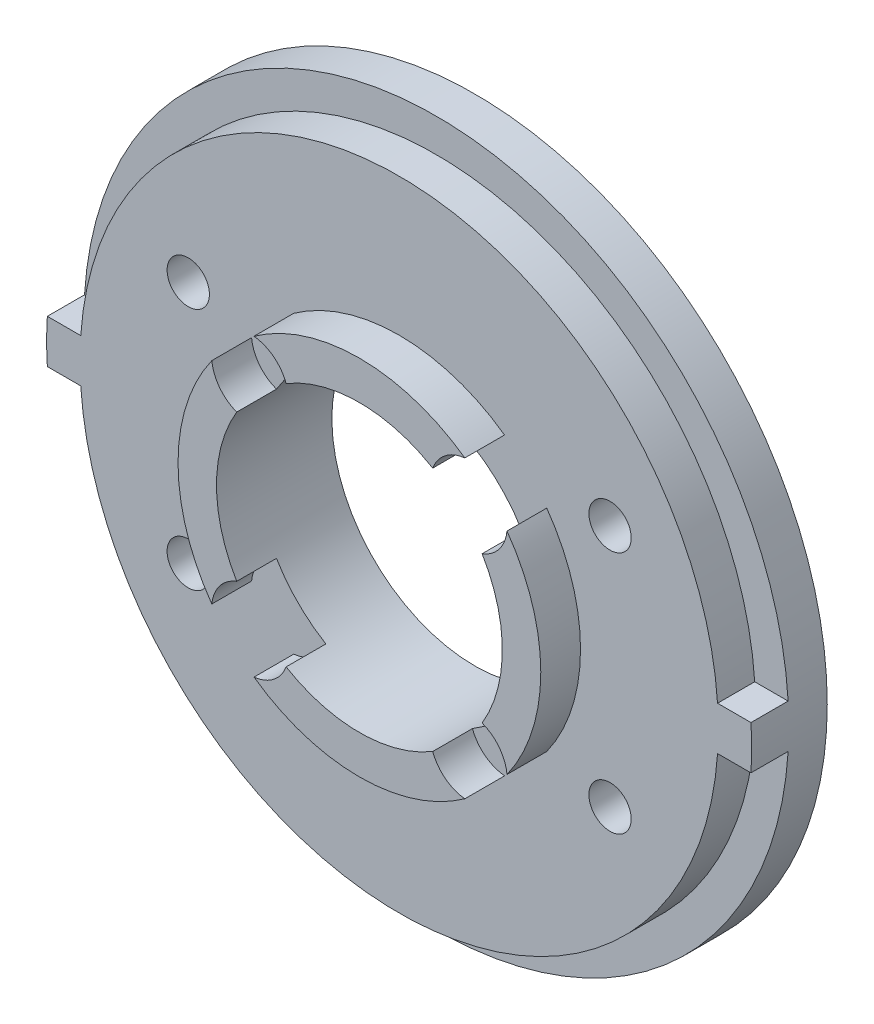
ISO-10303-21;
HEADER;
FILE_DESCRIPTION(('STEP AP214'),'2;1');
FILE_NAME('part.step','',(''),(''),'','','');
FILE_SCHEMA(('AUTOMOTIVE_DESIGN { 1 0 10303 214 1 1 1 1 }'));
ENDSEC;
DATA;
#1=APPLICATION_CONTEXT('core data for automotive mechanical design processes');
#2=APPLICATION_PROTOCOL_DEFINITION('international standard','automotive_design',2000,#1);
#3=PRODUCT_CONTEXT('',#1,'mechanical');
#4=PRODUCT('Part','Part','',(#3));
#5=PRODUCT_RELATED_PRODUCT_CATEGORY('part','',(#4));
#6=PRODUCT_DEFINITION_FORMATION('','',#4);
#7=PRODUCT_DEFINITION_CONTEXT('part definition',#1,'design');
#8=PRODUCT_DEFINITION('design','',#6,#7);
#9=PRODUCT_DEFINITION_SHAPE('','',#8);
#10=(LENGTH_UNIT() NAMED_UNIT(*) SI_UNIT(.MILLI.,.METRE.));
#11=(NAMED_UNIT(*) PLANE_ANGLE_UNIT() SI_UNIT($,.RADIAN.));
#12=(NAMED_UNIT(*) SI_UNIT($,.STERADIAN.) SOLID_ANGLE_UNIT());
#13=UNCERTAINTY_MEASURE_WITH_UNIT(LENGTH_MEASURE(1.E-05),#10,'distance_accuracy_value','');
#14=(GEOMETRIC_REPRESENTATION_CONTEXT(3) GLOBAL_UNCERTAINTY_ASSIGNED_CONTEXT((#13)) GLOBAL_UNIT_ASSIGNED_CONTEXT((#10,
#11,#12)) REPRESENTATION_CONTEXT('',''));
#15=CARTESIAN_POINT('',(0.,0.,0.));
#16=DIRECTION('',(0.,0.,1.));
#17=DIRECTION('',(1.,0.,0.));
#18=AXIS2_PLACEMENT_3D('',#15,#16,#17);
#19=CARTESIAN_POINT('',(0.,0.,9.));
#20=DIRECTION('',(0.,0.,1.));
#21=DIRECTION('',(1.,0.,0.));
#22=AXIS2_PLACEMENT_3D('',#19,#20,#21);
#23=PLANE('',#22);
#24=CARTESIAN_POINT('',(-8.53098997819986,-8.53098997819959,9.));
#25=DIRECTION('',(0.,0.,1.));
#26=DIRECTION('',(1.,0.,0.));
#27=AXIS2_PLACEMENT_3D('',#24,#25,#26);
#28=CIRCLE('',#27,3.);
#29=CARTESIAN_POINT('',(-9.57245655865993,-5.71756726524214,9.));
#30=VERTEX_POINT('',#29);
#31=CARTESIAN_POINT('',(-11.5151733018855,-8.2233377546799,9.));
#32=VERTEX_POINT('',#31);
#33=EDGE_CURVE('E451',#30,#32,#28,.T.);
#34=ORIENTED_EDGE('',*,*,#33,.F.);
#35=CARTESIAN_POINT('',(0.,0.,9.));
#36=DIRECTION('',(0.,0.,1.));
#37=DIRECTION('',(1.,0.,0.));
#38=AXIS2_PLACEMENT_3D('',#35,#36,#37);
#39=CIRCLE('',#38,11.15);
#40=CARTESIAN_POINT('',(-9.57245655865981,5.71756726524235,9.));
#41=VERTEX_POINT('',#40);
#42=EDGE_CURVE('E527',#41,#30,#39,.T.);
#43=ORIENTED_EDGE('',*,*,#42,.F.);
#44=CARTESIAN_POINT('',(-8.53098997819968,8.53098997819977,9.));
#45=DIRECTION('',(0.,0.,1.));
#46=DIRECTION('',(1.,0.,0.));
#47=AXIS2_PLACEMENT_3D('',#44,#45,#46);
#48=CIRCLE('',#47,3.);
#49=CARTESIAN_POINT('',(-11.5151733018853,8.22333775468014,9.));
#50=VERTEX_POINT('',#49);
#51=EDGE_CURVE('E214',#50,#41,#48,.T.);
#52=ORIENTED_EDGE('',*,*,#51,.F.);
#53=CARTESIAN_POINT('',(0.,0.,9.));
#54=DIRECTION('',(0.,0.,1.));
#55=DIRECTION('',(1.,0.,0.));
#56=AXIS2_PLACEMENT_3D('',#53,#54,#55);
#57=CIRCLE('',#56,14.15);
#58=EDGE_CURVE('E533',#50,#32,#57,.T.);
#59=ORIENTED_EDGE('',*,*,#58,.T.);
#60=EDGE_LOOP('',(#34,#43,#52,#59));
#61=FACE_BOUND('',#60,.T.);
#62=ADVANCED_FACE('F45',(#61),#23,.T.);
#63=CARTESIAN_POINT('',(8.53098997820016,-8.53098997819929,9.));
#64=DIRECTION('',(0.,0.,1.));
#65=DIRECTION('',(1.,0.,0.));
#66=AXIS2_PLACEMENT_3D('',#63,#64,#65);
#67=CIRCLE('',#66,3.00000000000068);
#68=CARTESIAN_POINT('',(11.5151733018864,-8.22333775467866,9.));
#69=VERTEX_POINT('',#68);
#70=CARTESIAN_POINT('',(9.57245655866048,-5.71756726524122,9.));
#71=VERTEX_POINT('',#70);
#72=EDGE_CURVE('E449',#69,#71,#67,.T.);
#73=ORIENTED_EDGE('',*,*,#72,.F.);
#74=CARTESIAN_POINT('',(11.5151733018854,8.22333775467998,9.));
#75=VERTEX_POINT('',#74);
#76=EDGE_CURVE('E288',#69,#75,#57,.T.);
#77=ORIENTED_EDGE('',*,*,#76,.T.);
#78=CARTESIAN_POINT('',(8.5309899781998,8.53098997819965,9.));
#79=DIRECTION('',(0.,0.,1.));
#80=DIRECTION('',(1.,0.,0.));
#81=AXIS2_PLACEMENT_3D('',#78,#79,#80);
#82=CIRCLE('',#81,3.);
#83=CARTESIAN_POINT('',(9.57245655865989,5.71756726524221,9.));
#84=VERTEX_POINT('',#83);
#85=EDGE_CURVE('E463',#84,#75,#82,.T.);
#86=ORIENTED_EDGE('',*,*,#85,.F.);
#87=EDGE_CURVE('E385',#71,#84,#39,.T.);
#88=ORIENTED_EDGE('',*,*,#87,.F.);
#89=EDGE_LOOP('',(#73,#77,#86,#88));
#90=FACE_BOUND('',#89,.T.);
#91=ADVANCED_FACE('F498',(#90),#23,.T.);
#92=CARTESIAN_POINT('',(8.22333775468018,11.5151733018853,9.));
#93=VERTEX_POINT('',#92);
#94=CARTESIAN_POINT('',(5.71756726524238,9.57245655865979,9.));
#95=VERTEX_POINT('',#94);
#96=EDGE_CURVE('E461',#93,#95,#82,.T.);
#97=ORIENTED_EDGE('',*,*,#96,.F.);
#98=CARTESIAN_POINT('',(-8.22333775468002,11.5151733018854,9.));
#99=VERTEX_POINT('',#98);
#100=EDGE_CURVE('E294',#93,#99,#57,.T.);
#101=ORIENTED_EDGE('',*,*,#100,.T.);
#102=CARTESIAN_POINT('',(-5.71756726524225,9.57245655865987,9.));
#103=VERTEX_POINT('',#102);
#104=EDGE_CURVE('E454',#103,#99,#48,.T.);
#105=ORIENTED_EDGE('',*,*,#104,.F.);
#106=EDGE_CURVE('E390',#95,#103,#39,.T.);
#107=ORIENTED_EDGE('',*,*,#106,.F.);
#108=EDGE_LOOP('',(#97,#101,#105,#107));
#109=FACE_BOUND('',#108,.T.);
#110=ADVANCED_FACE('F560',(#109),#23,.T.);
#111=CARTESIAN_POINT('',(0.,0.,5.9));
#112=DIRECTION('',(0.,0.,1.));
#113=DIRECTION('',(1.,0.,0.));
#114=AXIS2_PLACEMENT_3D('',#111,#112,#113);
#115=CYLINDRICAL_SURFACE('',#114,14.15);
#116=DIRECTION('',(0.,0.,1.));
#117=VECTOR('',#116,1.);
#118=CARTESIAN_POINT('',(-8.22333775468027,-11.5151733018852,7.45));
#119=LINE('',#118,#117);
#120=CARTESIAN_POINT('',(-8.22333775468027,-11.5151733018852,5.9));
#121=VERTEX_POINT('',#120);
#122=CARTESIAN_POINT('',(-8.22333775468027,-11.5151733018852,9.));
#123=VERTEX_POINT('',#122);
#124=EDGE_CURVE('E11',#121,#123,#119,.T.);
#125=ORIENTED_EDGE('',*,*,#124,.F.);
#126=CARTESIAN_POINT('',(0.,0.,5.9));
#127=DIRECTION('',(0.,0.,1.));
#128=DIRECTION('',(1.,0.,0.));
#129=AXIS2_PLACEMENT_3D('',#126,#127,#128);
#130=CIRCLE('',#129,14.15);
#131=CARTESIAN_POINT('',(8.22333775467983,-11.5151733018855,5.9));
#132=VERTEX_POINT('',#131);
#133=EDGE_CURVE('E293',#121,#132,#130,.T.);
#134=ORIENTED_EDGE('',*,*,#133,.T.);
#135=DIRECTION('',(0.,0.,1.));
#136=VECTOR('',#135,1.);
#137=CARTESIAN_POINT('',(8.22333775467983,-11.5151733018855,7.45));
#138=LINE('',#137,#136);
#139=CARTESIAN_POINT('',(8.22333775467983,-11.5151733018855,9.));
#140=VERTEX_POINT('',#139);
#141=EDGE_CURVE('E416',#140,#132,#138,.F.);
#142=ORIENTED_EDGE('',*,*,#141,.F.);
#143=EDGE_CURVE('E299',#123,#140,#57,.T.);
#144=ORIENTED_EDGE('',*,*,#143,.F.);
#145=EDGE_LOOP('',(#125,#134,#142,#144));
#146=FACE_BOUND('',#145,.T.);
#147=ADVANCED_FACE('F519',(#146),#115,.T.);
#148=DIRECTION('',(0.,0.,1.));
#149=VECTOR('',#148,1.);
#150=CARTESIAN_POINT('',(11.5151733018864,-8.22333775467865,7.45));
#151=LINE('',#150,#149);
#152=CARTESIAN_POINT('',(11.5151733018864,-8.22333775467866,5.9));
#153=VERTEX_POINT('',#152);
#154=EDGE_CURVE('E419',#153,#69,#151,.T.);
#155=ORIENTED_EDGE('',*,*,#154,.F.);
#156=CARTESIAN_POINT('',(11.5151733018854,8.22333775467998,5.9));
#157=VERTEX_POINT('',#156);
#158=EDGE_CURVE('E289',#153,#157,#130,.T.);
#159=ORIENTED_EDGE('',*,*,#158,.T.);
#160=DIRECTION('',(0.,0.,1.));
#161=VECTOR('',#160,1.);
#162=CARTESIAN_POINT('',(11.5151733018854,8.22333775467997,7.45));
#163=LINE('',#162,#161);
#164=EDGE_CURVE('E409',#75,#157,#163,.F.);
#165=ORIENTED_EDGE('',*,*,#164,.F.);
#166=ORIENTED_EDGE('',*,*,#76,.F.);
#167=EDGE_LOOP('',(#155,#159,#165,#166));
#168=FACE_BOUND('',#167,.T.);
#169=ADVANCED_FACE('F487',(#168),#115,.T.);
#170=DIRECTION('',(0.,0.,1.));
#171=VECTOR('',#170,1.);
#172=CARTESIAN_POINT('',(8.22333775468018,11.5151733018853,7.45));
#173=LINE('',#172,#171);
#174=CARTESIAN_POINT('',(8.22333775468018,11.5151733018853,5.9));
#175=VERTEX_POINT('',#174);
#176=EDGE_CURVE('E413',#175,#93,#173,.T.);
#177=ORIENTED_EDGE('',*,*,#176,.F.);
#178=CARTESIAN_POINT('',(-8.22333775468002,11.5151733018854,5.9));
#179=VERTEX_POINT('',#178);
#180=EDGE_CURVE('E295',#175,#179,#130,.T.);
#181=ORIENTED_EDGE('',*,*,#180,.T.);
#182=DIRECTION('',(0.,0.,1.));
#183=VECTOR('',#182,1.);
#184=CARTESIAN_POINT('',(-8.22333775468001,11.5151733018854,7.45));
#185=LINE('',#184,#183);
#186=EDGE_CURVE('E402',#99,#179,#185,.F.);
#187=ORIENTED_EDGE('',*,*,#186,.F.);
#188=ORIENTED_EDGE('',*,*,#100,.F.);
#189=EDGE_LOOP('',(#177,#181,#187,#188));
#190=FACE_BOUND('',#189,.T.);
#191=ADVANCED_FACE('F508',(#190),#115,.T.);
#192=CARTESIAN_POINT('',(-5.71756726524245,-9.57245655865974,9.));
#193=VERTEX_POINT('',#192);
#194=EDGE_CURVE('E446',#123,#193,#28,.T.);
#195=ORIENTED_EDGE('',*,*,#194,.F.);
#196=ORIENTED_EDGE('',*,*,#143,.T.);
#197=CARTESIAN_POINT('',(5.7175672652422,-9.5724565586599,9.));
#198=VERTEX_POINT('',#197);
#199=EDGE_CURVE('E473',#198,#140,#67,.T.);
#200=ORIENTED_EDGE('',*,*,#199,.F.);
#201=EDGE_CURVE('E389',#193,#198,#39,.T.);
#202=ORIENTED_EDGE('',*,*,#201,.F.);
#203=EDGE_LOOP('',(#195,#196,#200,#202));
#204=FACE_BOUND('',#203,.T.);
#205=ADVANCED_FACE('F540',(#204),#23,.T.);
#206=CARTESIAN_POINT('',(0.,0.,9.));
#207=DIRECTION('',(0.,0.,-1.));
#208=DIRECTION('',(-1.,0.,0.));
#209=AXIS2_PLACEMENT_3D('',#206,#207,#208);
#210=CYLINDRICAL_SURFACE('',#209,27.5);
#211=CARTESIAN_POINT('',(0.,0.,0.));
#212=DIRECTION('',(0.,0.,1.));
#213=DIRECTION('',(1.,0.,0.));
#214=AXIS2_PLACEMENT_3D('',#211,#212,#213);
#215=CIRCLE('',#214,27.5);
#216=CARTESIAN_POINT('',(27.5,0.,0.));
#217=VERTEX_POINT('',#216);
#218=EDGE_CURVE('E394',#217,#217,#215,.T.);
#219=ORIENTED_EDGE('',*,*,#218,.T.);
#220=EDGE_LOOP('',(#219));
#221=FACE_BOUND('',#220,.T.);
#222=CARTESIAN_POINT('',(0.,0.,5.9));
#223=DIRECTION('',(0.,0.,1.));
#224=DIRECTION('',(1.,0.,0.));
#225=AXIS2_PLACEMENT_3D('',#222,#223,#224);
#226=CIRCLE('',#225,27.5);
#227=CARTESIAN_POINT('',(-27.4474042488538,1.69999999999999,5.9));
#228=VERTEX_POINT('',#227);
#229=CARTESIAN_POINT('',(-27.4474042488538,-1.7,5.9));
#230=VERTEX_POINT('',#229);
#231=EDGE_CURVE('E311',#228,#230,#226,.T.);
#232=ORIENTED_EDGE('',*,*,#231,.F.);
#233=DIRECTION('',(0.,0.,1.));
#234=VECTOR('',#233,1.);
#235=CARTESIAN_POINT('',(-27.4474042488538,1.69999999999999,3.));
#236=LINE('',#235,#234);
#237=CARTESIAN_POINT('',(-27.4474042488538,1.69999999999999,3.));
#238=VERTEX_POINT('',#237);
#239=EDGE_CURVE('E364',#238,#228,#236,.T.);
#240=ORIENTED_EDGE('',*,*,#239,.F.);
#241=CARTESIAN_POINT('',(0.,0.,3.));
#242=DIRECTION('',(0.,0.,1.));
#243=DIRECTION('',(1.,0.,0.));
#244=AXIS2_PLACEMENT_3D('',#241,#242,#243);
#245=CIRCLE('',#244,27.5);
#246=CARTESIAN_POINT('',(27.4474042488538,1.7,3.));
#247=VERTEX_POINT('',#246);
#248=EDGE_CURVE('E372',#247,#238,#245,.T.);
#249=ORIENTED_EDGE('',*,*,#248,.F.);
#250=DIRECTION('',(0.,0.,1.));
#251=VECTOR('',#250,1.);
#252=CARTESIAN_POINT('',(27.4474042488538,1.7,3.));
#253=LINE('',#252,#251);
#254=CARTESIAN_POINT('',(27.4474042488539,1.7,5.9));
#255=VERTEX_POINT('',#254);
#256=EDGE_CURVE('E368',#247,#255,#253,.T.);
#257=ORIENTED_EDGE('',*,*,#256,.T.);
#258=CARTESIAN_POINT('',(27.4474042488538,-1.7,5.9));
#259=VERTEX_POINT('',#258);
#260=EDGE_CURVE('E308',#259,#255,#226,.T.);
#261=ORIENTED_EDGE('',*,*,#260,.F.);
#262=DIRECTION('',(0.,0.,1.));
#263=VECTOR('',#262,1.);
#264=CARTESIAN_POINT('',(27.4474042488538,-1.7,3.));
#265=LINE('',#264,#263);
#266=CARTESIAN_POINT('',(27.4474042488538,-1.7,3.));
#267=VERTEX_POINT('',#266);
#268=EDGE_CURVE('E344',#267,#259,#265,.T.);
#269=ORIENTED_EDGE('',*,*,#268,.F.);
#270=CARTESIAN_POINT('',(0.,0.,3.));
#271=DIRECTION('',(0.,0.,1.));
#272=DIRECTION('',(1.,0.,0.));
#273=AXIS2_PLACEMENT_3D('',#270,#271,#272);
#274=CIRCLE('',#273,27.5);
#275=CARTESIAN_POINT('',(-27.4474042488538,-1.7,3.));
#276=VERTEX_POINT('',#275);
#277=EDGE_CURVE('E336',#276,#267,#274,.T.);
#278=ORIENTED_EDGE('',*,*,#277,.F.);
#279=DIRECTION('',(0.,0.,1.));
#280=VECTOR('',#279,1.);
#281=CARTESIAN_POINT('',(-27.4474042488538,-1.69999999999999,3.));
#282=LINE('',#281,#280);
#283=EDGE_CURVE('E340',#276,#230,#282,.T.);
#284=ORIENTED_EDGE('',*,*,#283,.T.);
#285=EDGE_LOOP('',(#232,#240,#249,#257,#261,#269,#278,#284));
#286=FACE_BOUND('',#285,.T.);
#287=ADVANCED_FACE('F47',(#221,#286),#210,.T.);
#288=CARTESIAN_POINT('',(0.,1.7,3.));
#289=DIRECTION('',(0.,1.,0.));
#290=DIRECTION('',(-1.,0.,0.));
#291=AXIS2_PLACEMENT_3D('',#288,#289,#290);
#292=PLANE('',#291);
#293=DIRECTION('',(0.,0.,1.));
#294=VECTOR('',#293,1.);
#295=CARTESIAN_POINT('',(24.8401766298068,1.7,3.));
#296=LINE('',#295,#294);
#297=CARTESIAN_POINT('',(24.8401766298068,1.7,3.));
#298=VERTEX_POINT('',#297);
#299=CARTESIAN_POINT('',(24.8401766298068,1.7,5.9));
#300=VERTEX_POINT('',#299);
#301=EDGE_CURVE('E324',#298,#300,#296,.T.);
#302=ORIENTED_EDGE('',*,*,#301,.T.);
#303=DIRECTION('',(1.,0.,0.));
#304=VECTOR('',#303,1.);
#305=CARTESIAN_POINT('',(0.,1.7,5.9));
#306=LINE('',#305,#304);
#307=EDGE_CURVE('E320',#300,#255,#306,.T.);
#308=ORIENTED_EDGE('',*,*,#307,.T.);
#309=ORIENTED_EDGE('',*,*,#256,.F.);
#310=DIRECTION('',(-1.,0.,0.));
#311=VECTOR('',#310,1.);
#312=CARTESIAN_POINT('',(0.,1.7,3.));
#313=LINE('',#312,#311);
#314=EDGE_CURVE('E330',#247,#298,#313,.T.);
#315=ORIENTED_EDGE('',*,*,#314,.T.);
#316=EDGE_LOOP('',(#302,#308,#309,#315));
#317=FACE_BOUND('',#316,.T.);
#318=ADVANCED_FACE('F567',(#317),#292,.T.);
#319=CARTESIAN_POINT('',(0.,0.,3.));
#320=DIRECTION('',(0.,0.,1.));
#321=DIRECTION('',(1.,0.,0.));
#322=AXIS2_PLACEMENT_3D('',#319,#320,#321);
#323=CYLINDRICAL_SURFACE('',#322,24.8982805631232);
#324=DIRECTION('',(0.,0.,1.));
#325=VECTOR('',#324,1.);
#326=CARTESIAN_POINT('',(-24.8401766298068,1.7,3.));
#327=LINE('',#326,#325);
#328=CARTESIAN_POINT('',(-24.8401766298068,1.7,3.));
#329=VERTEX_POINT('',#328);
#330=CARTESIAN_POINT('',(-24.8401766298068,1.7,5.9));
#331=VERTEX_POINT('',#330);
#332=EDGE_CURVE('E360',#329,#331,#327,.T.);
#333=ORIENTED_EDGE('',*,*,#332,.T.);
#334=CARTESIAN_POINT('',(0.,0.,5.9));
#335=DIRECTION('',(0.,0.,1.));
#336=DIRECTION('',(1.,0.,0.));
#337=AXIS2_PLACEMENT_3D('',#334,#335,#336);
#338=CIRCLE('',#337,24.8982805631232);
#339=EDGE_CURVE('E316',#331,#300,#338,.F.);
#340=ORIENTED_EDGE('',*,*,#339,.T.);
#341=ORIENTED_EDGE('',*,*,#301,.F.);
#342=CARTESIAN_POINT('',(0.,0.,3.));
#343=DIRECTION('',(0.,0.,1.));
#344=DIRECTION('',(1.,0.,0.));
#345=AXIS2_PLACEMENT_3D('',#342,#343,#344);
#346=CIRCLE('',#345,24.8982805631232);
#347=EDGE_CURVE('E379',#298,#329,#346,.T.);
#348=ORIENTED_EDGE('',*,*,#347,.T.);
#349=EDGE_LOOP('',(#333,#340,#341,#348));
#350=FACE_BOUND('',#349,.T.);
#351=ADVANCED_FACE('F676',(#350),#323,.T.);
#352=CARTESIAN_POINT('',(0.,1.7,3.));
#353=DIRECTION('',(0.,1.,0.));
#354=DIRECTION('',(-1.,0.,0.));
#355=AXIS2_PLACEMENT_3D('',#352,#353,#354);
#356=PLANE('',#355);
#357=ORIENTED_EDGE('',*,*,#239,.T.);
#358=DIRECTION('',(1.,0.,0.));
#359=VECTOR('',#358,1.);
#360=CARTESIAN_POINT('',(0.,1.7,5.9));
#361=LINE('',#360,#359);
#362=EDGE_CURVE('E312',#228,#331,#361,.T.);
#363=ORIENTED_EDGE('',*,*,#362,.T.);
#364=ORIENTED_EDGE('',*,*,#332,.F.);
#365=DIRECTION('',(-1.,0.,0.));
#366=VECTOR('',#365,1.);
#367=CARTESIAN_POINT('',(0.,1.7,3.));
#368=LINE('',#367,#366);
#369=EDGE_CURVE('E376',#329,#238,#368,.T.);
#370=ORIENTED_EDGE('',*,*,#369,.T.);
#371=EDGE_LOOP('',(#357,#363,#364,#370));
#372=FACE_BOUND('',#371,.T.);
#373=ADVANCED_FACE('F672',(#372),#356,.T.);
#374=CARTESIAN_POINT('',(0.,-1.7,3.));
#375=DIRECTION('',(0.,-1.,0.));
#376=DIRECTION('',(0.,0.,-1.));
#377=AXIS2_PLACEMENT_3D('',#374,#375,#376);
#378=PLANE('',#377);
#379=DIRECTION('',(0.,0.,1.));
#380=VECTOR('',#379,1.);
#381=CARTESIAN_POINT('',(-24.8419000883588,-1.7,3.));
#382=LINE('',#381,#380);
#383=CARTESIAN_POINT('',(-24.8419000883588,-1.7,3.));
#384=VERTEX_POINT('',#383);
#385=CARTESIAN_POINT('',(-24.8419000883588,-1.7,5.9));
#386=VERTEX_POINT('',#385);
#387=EDGE_CURVE('E352',#384,#386,#382,.T.);
#388=ORIENTED_EDGE('',*,*,#387,.T.);
#389=DIRECTION('',(-1.,0.,0.));
#390=VECTOR('',#389,1.);
#391=CARTESIAN_POINT('',(0.,-1.7,5.9));
#392=LINE('',#391,#390);
#393=EDGE_CURVE('E304',#386,#230,#392,.T.);
#394=ORIENTED_EDGE('',*,*,#393,.T.);
#395=ORIENTED_EDGE('',*,*,#283,.F.);
#396=DIRECTION('',(1.,0.,0.));
#397=VECTOR('',#396,1.);
#398=CARTESIAN_POINT('',(0.,-1.7,3.));
#399=LINE('',#398,#397);
#400=EDGE_CURVE('E325',#276,#384,#399,.T.);
#401=ORIENTED_EDGE('',*,*,#400,.T.);
#402=EDGE_LOOP('',(#388,#394,#395,#401));
#403=FACE_BOUND('',#402,.T.);
#404=ADVANCED_FACE('F675',(#403),#378,.T.);
#405=CARTESIAN_POINT('',(0.,0.,3.));
#406=DIRECTION('',(0.,0.,1.));
#407=DIRECTION('',(1.,0.,0.));
#408=AXIS2_PLACEMENT_3D('',#405,#406,#407);
#409=CYLINDRICAL_SURFACE('',#408,24.9);
#410=DIRECTION('',(0.,0.,1.));
#411=VECTOR('',#410,1.);
#412=CARTESIAN_POINT('',(24.8419000883588,-1.7,3.));
#413=LINE('',#412,#411);
#414=CARTESIAN_POINT('',(24.8419000883588,-1.7,3.));
#415=VERTEX_POINT('',#414);
#416=CARTESIAN_POINT('',(24.8419000883588,-1.7,5.9));
#417=VERTEX_POINT('',#416);
#418=EDGE_CURVE('E348',#415,#417,#413,.T.);
#419=ORIENTED_EDGE('',*,*,#418,.T.);
#420=CARTESIAN_POINT('',(0.,0.,5.9));
#421=DIRECTION('',(0.,0.,1.));
#422=DIRECTION('',(1.,0.,0.));
#423=AXIS2_PLACEMENT_3D('',#420,#421,#422);
#424=CIRCLE('',#423,24.9);
#425=EDGE_CURVE('E300',#417,#386,#424,.F.);
#426=ORIENTED_EDGE('',*,*,#425,.T.);
#427=ORIENTED_EDGE('',*,*,#387,.F.);
#428=CARTESIAN_POINT('',(0.,0.,3.));
#429=DIRECTION('',(0.,0.,1.));
#430=DIRECTION('',(1.,0.,0.));
#431=AXIS2_PLACEMENT_3D('',#428,#429,#430);
#432=CIRCLE('',#431,24.9);
#433=EDGE_CURVE('E329',#384,#415,#432,.T.);
#434=ORIENTED_EDGE('',*,*,#433,.T.);
#435=EDGE_LOOP('',(#419,#426,#427,#434));
#436=FACE_BOUND('',#435,.T.);
#437=ADVANCED_FACE('F686',(#436),#409,.T.);
#438=CARTESIAN_POINT('',(0.,-1.7,3.));
#439=DIRECTION('',(0.,-1.,0.));
#440=DIRECTION('',(0.,0.,-1.));
#441=AXIS2_PLACEMENT_3D('',#438,#439,#440);
#442=PLANE('',#441);
#443=ORIENTED_EDGE('',*,*,#268,.T.);
#444=DIRECTION('',(-1.,0.,0.));
#445=VECTOR('',#444,1.);
#446=CARTESIAN_POINT('',(0.,-1.7,5.9));
#447=LINE('',#446,#445);
#448=EDGE_CURVE('E398',#259,#417,#447,.T.);
#449=ORIENTED_EDGE('',*,*,#448,.T.);
#450=ORIENTED_EDGE('',*,*,#418,.F.);
#451=DIRECTION('',(1.,0.,0.));
#452=VECTOR('',#451,1.);
#453=CARTESIAN_POINT('',(0.,-1.7,3.));
#454=LINE('',#453,#452);
#455=EDGE_CURVE('E333',#415,#267,#454,.T.);
#456=ORIENTED_EDGE('',*,*,#455,.T.);
#457=EDGE_LOOP('',(#443,#449,#450,#456));
#458=FACE_BOUND('',#457,.T.);
#459=ADVANCED_FACE('F658',(#458),#442,.T.);
#460=CARTESIAN_POINT('',(0.,0.,0.));
#461=DIRECTION('',(0.,0.,1.));
#462=DIRECTION('',(1.,0.,0.));
#463=AXIS2_PLACEMENT_3D('',#460,#461,#462);
#464=PLANE('',#463);
#465=CARTESIAN_POINT('',(16.4544826719043,9.50000000000008,0.));
#466=DIRECTION('',(0.,0.,1.));
#467=DIRECTION('',(1.,0.,0.));
#468=AXIS2_PLACEMENT_3D('',#465,#466,#467);
#469=CIRCLE('',#468,3.3);
#470=CARTESIAN_POINT('',(19.7544826719043,9.50000000000008,0.));
#471=VERTEX_POINT('',#470);
#472=EDGE_CURVE('E640',#471,#471,#469,.T.);
#473=ORIENTED_EDGE('',*,*,#472,.T.);
#474=EDGE_LOOP('',(#473));
#475=FACE_BOUND('',#474,.T.);
#476=CARTESIAN_POINT('',(16.4544826719043,-9.50000000000008,0.));
#477=DIRECTION('',(0.,0.,1.));
#478=DIRECTION('',(1.,0.,0.));
#479=AXIS2_PLACEMENT_3D('',#476,#477,#478);
#480=CIRCLE('',#479,3.3);
#481=CARTESIAN_POINT('',(19.7544826719043,-9.50000000000008,0.));
#482=VERTEX_POINT('',#481);
#483=EDGE_CURVE('E630',#482,#482,#480,.T.);
#484=ORIENTED_EDGE('',*,*,#483,.T.);
#485=EDGE_LOOP('',(#484));
#486=FACE_BOUND('',#485,.T.);
#487=CARTESIAN_POINT('',(-16.4544826719043,-9.50000000000007,0.));
#488=DIRECTION('',(0.,0.,1.));
#489=DIRECTION('',(1.,0.,0.));
#490=AXIS2_PLACEMENT_3D('',#487,#488,#489);
#491=CIRCLE('',#490,3.3);
#492=CARTESIAN_POINT('',(-13.1544826719043,-9.50000000000007,0.));
#493=VERTEX_POINT('',#492);
#494=EDGE_CURVE('E622',#493,#493,#491,.T.);
#495=ORIENTED_EDGE('',*,*,#494,.T.);
#496=EDGE_LOOP('',(#495));
#497=FACE_BOUND('',#496,.T.);
#498=CARTESIAN_POINT('',(-16.4544826719043,9.50000000000007,0.));
#499=DIRECTION('',(0.,0.,1.));
#500=DIRECTION('',(1.,0.,0.));
#501=AXIS2_PLACEMENT_3D('',#498,#499,#500);
#502=CIRCLE('',#501,3.3);
#503=CARTESIAN_POINT('',(-13.1544826719043,9.50000000000007,0.));
#504=VERTEX_POINT('',#503);
#505=EDGE_CURVE('E625',#504,#504,#502,.T.);
#506=ORIENTED_EDGE('',*,*,#505,.T.);
#507=EDGE_LOOP('',(#506));
#508=FACE_BOUND('',#507,.T.);
#509=ORIENTED_EDGE('',*,*,#218,.F.);
#510=EDGE_LOOP('',(#509));
#511=FACE_BOUND('',#510,.T.);
#512=CARTESIAN_POINT('',(0.,0.,0.));
#513=DIRECTION('',(0.,0.,1.));
#514=DIRECTION('',(1.,0.,0.));
#515=AXIS2_PLACEMENT_3D('',#512,#513,#514);
#516=CIRCLE('',#515,11.15);
#517=CARTESIAN_POINT('',(11.15,0.,0.));
#518=VERTEX_POINT('',#517);
#519=EDGE_CURVE('E356',#518,#518,#516,.T.);
#520=ORIENTED_EDGE('',*,*,#519,.T.);
#521=EDGE_LOOP('',(#520));
#522=FACE_BOUND('',#521,.T.);
#523=ADVANCED_FACE('F655',(#475,#486,#497,#508,#511,#522),#464,.F.);
#524=CARTESIAN_POINT('',(0.,0.,9.));
#525=DIRECTION('',(0.,0.,-1.));
#526=DIRECTION('',(-1.,0.,0.));
#527=AXIS2_PLACEMENT_3D('',#524,#525,#526);
#528=CYLINDRICAL_SURFACE('',#527,11.15);
#529=DIRECTION('',(0.,0.,1.));
#530=VECTOR('',#529,1.);
#531=CARTESIAN_POINT('',(-9.57245655865993,-5.71756726524214,7.45));
#532=LINE('',#531,#530);
#533=CARTESIAN_POINT('',(-9.57245655865993,-5.71756726524214,5.9));
#534=VERTEX_POINT('',#533);
#535=EDGE_CURVE('E269',#534,#30,#532,.T.);
#536=ORIENTED_EDGE('',*,*,#535,.F.);
#537=CARTESIAN_POINT('',(0.,0.,5.9));
#538=DIRECTION('',(0.,0.,1.));
#539=DIRECTION('',(1.,0.,0.));
#540=AXIS2_PLACEMENT_3D('',#537,#538,#539);
#541=CIRCLE('',#540,11.15);
#542=CARTESIAN_POINT('',(-5.71756726524245,-9.57245655865974,5.9));
#543=VERTEX_POINT('',#542);
#544=EDGE_CURVE('E262',#534,#543,#541,.T.);
#545=ORIENTED_EDGE('',*,*,#544,.T.);
#546=DIRECTION('',(0.,0.,1.));
#547=VECTOR('',#546,1.);
#548=CARTESIAN_POINT('',(-5.71756726524245,-9.57245655865975,7.45));
#549=LINE('',#548,#547);
#550=EDGE_CURVE('E266',#193,#543,#549,.F.);
#551=ORIENTED_EDGE('',*,*,#550,.F.);
#552=ORIENTED_EDGE('',*,*,#201,.T.);
#553=DIRECTION('',(0.,0.,1.));
#554=VECTOR('',#553,1.);
#555=CARTESIAN_POINT('',(5.7175672652422,-9.5724565586599,7.45));
#556=LINE('',#555,#554);
#557=CARTESIAN_POINT('',(5.7175672652422,-9.5724565586599,5.9));
#558=VERTEX_POINT('',#557);
#559=EDGE_CURVE('E259',#558,#198,#556,.T.);
#560=ORIENTED_EDGE('',*,*,#559,.F.);
#561=CARTESIAN_POINT('',(0.,0.,5.9));
#562=DIRECTION('',(0.,0.,1.));
#563=DIRECTION('',(1.,0.,0.));
#564=AXIS2_PLACEMENT_3D('',#561,#562,#563);
#565=CIRCLE('',#564,11.15);
#566=CARTESIAN_POINT('',(9.57245655866048,-5.71756726524122,5.9));
#567=VERTEX_POINT('',#566);
#568=EDGE_CURVE('E252',#558,#567,#565,.T.);
#569=ORIENTED_EDGE('',*,*,#568,.T.);
#570=DIRECTION('',(0.,0.,1.));
#571=VECTOR('',#570,1.);
#572=CARTESIAN_POINT('',(9.57245655866048,-5.71756726524122,7.45));
#573=LINE('',#572,#571);
#574=EDGE_CURVE('E256',#71,#567,#573,.F.);
#575=ORIENTED_EDGE('',*,*,#574,.F.);
#576=ORIENTED_EDGE('',*,*,#87,.T.);
#577=DIRECTION('',(0.,0.,1.));
#578=VECTOR('',#577,1.);
#579=CARTESIAN_POINT('',(9.57245655865989,5.71756726524221,7.45));
#580=LINE('',#579,#578);
#581=CARTESIAN_POINT('',(9.57245655865989,5.71756726524221,5.9));
#582=VERTEX_POINT('',#581);
#583=EDGE_CURVE('E249',#582,#84,#580,.T.);
#584=ORIENTED_EDGE('',*,*,#583,.F.);
#585=CARTESIAN_POINT('',(0.,0.,5.9));
#586=DIRECTION('',(0.,0.,1.));
#587=DIRECTION('',(1.,0.,0.));
#588=AXIS2_PLACEMENT_3D('',#585,#586,#587);
#589=CIRCLE('',#588,11.15);
#590=CARTESIAN_POINT('',(5.71756726524238,9.57245655865979,5.9));
#591=VERTEX_POINT('',#590);
#592=EDGE_CURVE('E242',#582,#591,#589,.T.);
#593=ORIENTED_EDGE('',*,*,#592,.T.);
#594=DIRECTION('',(0.,0.,1.));
#595=VECTOR('',#594,1.);
#596=CARTESIAN_POINT('',(5.71756726524238,9.57245655865979,7.45));
#597=LINE('',#596,#595);
#598=EDGE_CURVE('E246',#95,#591,#597,.F.);
#599=ORIENTED_EDGE('',*,*,#598,.F.);
#600=ORIENTED_EDGE('',*,*,#106,.T.);
#601=DIRECTION('',(0.,0.,1.));
#602=VECTOR('',#601,1.);
#603=CARTESIAN_POINT('',(-5.71756726524225,9.57245655865987,7.45));
#604=LINE('',#603,#602);
#605=CARTESIAN_POINT('',(-5.71756726524225,9.57245655865987,5.9));
#606=VERTEX_POINT('',#605);
#607=EDGE_CURVE('E220',#606,#103,#604,.T.);
#608=ORIENTED_EDGE('',*,*,#607,.F.);
#609=CARTESIAN_POINT('',(0.,0.,5.9));
#610=DIRECTION('',(0.,0.,1.));
#611=DIRECTION('',(1.,0.,0.));
#612=AXIS2_PLACEMENT_3D('',#609,#610,#611);
#613=CIRCLE('',#612,11.15);
#614=CARTESIAN_POINT('',(-9.57245655865981,5.71756726524235,5.9));
#615=VERTEX_POINT('',#614);
#616=EDGE_CURVE('E221',#606,#615,#613,.T.);
#617=ORIENTED_EDGE('',*,*,#616,.T.);
#618=DIRECTION('',(0.,0.,1.));
#619=VECTOR('',#618,1.);
#620=CARTESIAN_POINT('',(-9.57245655865981,5.71756726524235,7.45));
#621=LINE('',#620,#619);
#622=EDGE_CURVE('E208',#41,#615,#621,.F.);
#623=ORIENTED_EDGE('',*,*,#622,.F.);
#624=ORIENTED_EDGE('',*,*,#42,.T.);
#625=EDGE_LOOP('',(#536,#545,#551,#552,#560,#569,#575,#576,#584,#593,#599,#600,#608,#617,#623,#624));
#626=FACE_BOUND('',#625,.T.);
#627=ORIENTED_EDGE('',*,*,#519,.F.);
#628=EDGE_LOOP('',(#627));
#629=FACE_BOUND('',#628,.T.);
#630=ADVANCED_FACE('F233',(#626,#629),#528,.F.);
#631=CARTESIAN_POINT('',(0.,0.,3.));
#632=DIRECTION('',(0.,0.,1.));
#633=DIRECTION('',(1.,0.,0.));
#634=AXIS2_PLACEMENT_3D('',#631,#632,#633);
#635=PLANE('',#634);
#636=ORIENTED_EDGE('',*,*,#314,.F.);
#637=ORIENTED_EDGE('',*,*,#248,.T.);
#638=ORIENTED_EDGE('',*,*,#369,.F.);
#639=ORIENTED_EDGE('',*,*,#347,.F.);
#640=EDGE_LOOP('',(#636,#637,#638,#639));
#641=FACE_BOUND('',#640,.T.);
#642=ADVANCED_FACE('F664',(#641),#635,.T.);
#643=CARTESIAN_POINT('',(0.,0.,3.));
#644=DIRECTION('',(0.,0.,1.));
#645=DIRECTION('',(1.,0.,0.));
#646=AXIS2_PLACEMENT_3D('',#643,#644,#645);
#647=PLANE('',#646);
#648=ORIENTED_EDGE('',*,*,#400,.F.);
#649=ORIENTED_EDGE('',*,*,#277,.T.);
#650=ORIENTED_EDGE('',*,*,#455,.F.);
#651=ORIENTED_EDGE('',*,*,#433,.F.);
#652=EDGE_LOOP('',(#648,#649,#650,#651));
#653=FACE_BOUND('',#652,.T.);
#654=ADVANCED_FACE('F668',(#653),#647,.T.);
#655=CARTESIAN_POINT('',(0.,0.,5.9));
#656=DIRECTION('',(0.,0.,1.));
#657=DIRECTION('',(1.,0.,0.));
#658=AXIS2_PLACEMENT_3D('',#655,#656,#657);
#659=PLANE('',#658);
#660=ORIENTED_EDGE('',*,*,#133,.F.);
#661=CARTESIAN_POINT('',(-8.53098997819986,-8.53098997819959,5.9));
#662=DIRECTION('',(0.,0.,1.));
#663=DIRECTION('',(1.,0.,0.));
#664=AXIS2_PLACEMENT_3D('',#661,#662,#663);
#665=CIRCLE('',#664,3.);
#666=EDGE_CURVE('E442',#543,#121,#665,.F.);
#667=ORIENTED_EDGE('',*,*,#666,.F.);
#668=ORIENTED_EDGE('',*,*,#544,.F.);
#669=CARTESIAN_POINT('',(-11.5151733018855,-8.2233377546799,5.9));
#670=VERTEX_POINT('',#669);
#671=EDGE_CURVE('E70',#670,#534,#665,.F.);
#672=ORIENTED_EDGE('',*,*,#671,.F.);
#673=CARTESIAN_POINT('',(-11.5151733018853,8.22333775468014,5.9));
#674=VERTEX_POINT('',#673);
#675=EDGE_CURVE('E227',#674,#670,#130,.T.);
#676=ORIENTED_EDGE('',*,*,#675,.F.);
#677=CARTESIAN_POINT('',(-8.53098997819968,8.53098997819977,5.9));
#678=DIRECTION('',(0.,0.,1.));
#679=DIRECTION('',(1.,0.,0.));
#680=AXIS2_PLACEMENT_3D('',#677,#678,#679);
#681=CIRCLE('',#680,3.);
#682=EDGE_CURVE('E211',#615,#674,#681,.F.);
#683=ORIENTED_EDGE('',*,*,#682,.F.);
#684=ORIENTED_EDGE('',*,*,#616,.F.);
#685=EDGE_CURVE('E229',#179,#606,#681,.F.);
#686=ORIENTED_EDGE('',*,*,#685,.F.);
#687=ORIENTED_EDGE('',*,*,#180,.F.);
#688=CARTESIAN_POINT('',(8.5309899781998,8.53098997819965,5.9));
#689=DIRECTION('',(0.,0.,1.));
#690=DIRECTION('',(1.,0.,0.));
#691=AXIS2_PLACEMENT_3D('',#688,#689,#690);
#692=CIRCLE('',#691,3.);
#693=EDGE_CURVE('E494',#591,#175,#692,.F.);
#694=ORIENTED_EDGE('',*,*,#693,.F.);
#695=ORIENTED_EDGE('',*,*,#592,.F.);
#696=EDGE_CURVE('E469',#157,#582,#692,.F.);
#697=ORIENTED_EDGE('',*,*,#696,.F.);
#698=ORIENTED_EDGE('',*,*,#158,.F.);
#699=CARTESIAN_POINT('',(8.53098997820016,-8.53098997819929,5.9));
#700=DIRECTION('',(0.,0.,1.));
#701=DIRECTION('',(1.,0.,0.));
#702=AXIS2_PLACEMENT_3D('',#699,#700,#701);
#703=CIRCLE('',#702,3.00000000000068);
#704=EDGE_CURVE('E453',#567,#153,#703,.F.);
#705=ORIENTED_EDGE('',*,*,#704,.F.);
#706=ORIENTED_EDGE('',*,*,#568,.F.);
#707=EDGE_CURVE('E63',#132,#558,#703,.F.);
#708=ORIENTED_EDGE('',*,*,#707,.F.);
#709=EDGE_LOOP('',(#660,#667,#668,#672,#676,#683,#684,#686,#687,#694,#695,#697,#698,#705,#706,#708));
#710=FACE_BOUND('',#709,.T.);
#711=CARTESIAN_POINT('',(-16.4544826719043,-9.50000000000007,5.9));
#712=DIRECTION('',(0.,0.,1.));
#713=DIRECTION('',(1.,0.,0.));
#714=AXIS2_PLACEMENT_3D('',#711,#712,#713);
#715=CIRCLE('',#714,1.65);
#716=CARTESIAN_POINT('',(-14.8044826719043,-9.50000000000007,5.9));
#717=VERTEX_POINT('',#716);
#718=EDGE_CURVE('E272',#717,#717,#715,.T.);
#719=ORIENTED_EDGE('',*,*,#718,.F.);
#720=EDGE_LOOP('',(#719));
#721=FACE_BOUND('',#720,.T.);
#722=CARTESIAN_POINT('',(16.4544826719043,-9.50000000000008,5.9));
#723=DIRECTION('',(0.,0.,1.));
#724=DIRECTION('',(1.,0.,0.));
#725=AXIS2_PLACEMENT_3D('',#722,#723,#724);
#726=CIRCLE('',#725,1.65);
#727=CARTESIAN_POINT('',(18.1044826719043,-9.50000000000008,5.9));
#728=VERTEX_POINT('',#727);
#729=EDGE_CURVE('E278',#728,#728,#726,.T.);
#730=ORIENTED_EDGE('',*,*,#729,.F.);
#731=EDGE_LOOP('',(#730));
#732=FACE_BOUND('',#731,.T.);
#733=CARTESIAN_POINT('',(16.4544826719043,9.50000000000008,5.9));
#734=DIRECTION('',(0.,0.,1.));
#735=DIRECTION('',(1.,0.,0.));
#736=AXIS2_PLACEMENT_3D('',#733,#734,#735);
#737=CIRCLE('',#736,1.65);
#738=CARTESIAN_POINT('',(18.1044826719043,9.50000000000008,5.9));
#739=VERTEX_POINT('',#738);
#740=EDGE_CURVE('E273',#739,#739,#737,.T.);
#741=ORIENTED_EDGE('',*,*,#740,.F.);
#742=EDGE_LOOP('',(#741));
#743=FACE_BOUND('',#742,.T.);
#744=CARTESIAN_POINT('',(-16.4544826719043,9.50000000000007,5.9));
#745=DIRECTION('',(0.,0.,1.));
#746=DIRECTION('',(1.,0.,0.));
#747=AXIS2_PLACEMENT_3D('',#744,#745,#746);
#748=CIRCLE('',#747,1.65);
#749=CARTESIAN_POINT('',(-14.8044826719043,9.50000000000007,5.9));
#750=VERTEX_POINT('',#749);
#751=EDGE_CURVE('E277',#750,#750,#748,.T.);
#752=ORIENTED_EDGE('',*,*,#751,.F.);
#753=EDGE_LOOP('',(#752));
#754=FACE_BOUND('',#753,.T.);
#755=ORIENTED_EDGE('',*,*,#339,.F.);
#756=ORIENTED_EDGE('',*,*,#362,.F.);
#757=ORIENTED_EDGE('',*,*,#231,.T.);
#758=ORIENTED_EDGE('',*,*,#393,.F.);
#759=ORIENTED_EDGE('',*,*,#425,.F.);
#760=ORIENTED_EDGE('',*,*,#448,.F.);
#761=ORIENTED_EDGE('',*,*,#260,.T.);
#762=ORIENTED_EDGE('',*,*,#307,.F.);
#763=EDGE_LOOP('',(#755,#756,#757,#758,#759,#760,#761,#762));
#764=FACE_BOUND('',#763,.T.);
#765=ADVANCED_FACE('F223',(#710,#721,#732,#743,#754,#764),#659,.T.);
#766=DIRECTION('',(0.,0.,1.));
#767=VECTOR('',#766,1.);
#768=CARTESIAN_POINT('',(-11.5151733018855,-8.2233377546799,7.45));
#769=LINE('',#768,#767);
#770=EDGE_CURVE('E55',#32,#670,#769,.F.);
#771=ORIENTED_EDGE('',*,*,#770,.F.);
#772=ORIENTED_EDGE('',*,*,#58,.F.);
#773=DIRECTION('',(0.,0.,1.));
#774=VECTOR('',#773,1.);
#775=CARTESIAN_POINT('',(-11.5151733018853,8.22333775468013,7.45));
#776=LINE('',#775,#774);
#777=EDGE_CURVE('E406',#674,#50,#776,.T.);
#778=ORIENTED_EDGE('',*,*,#777,.F.);
#779=ORIENTED_EDGE('',*,*,#675,.T.);
#780=EDGE_LOOP('',(#771,#772,#778,#779));
#781=FACE_BOUND('',#780,.T.);
#782=ADVANCED_FACE('F570',(#781),#115,.T.);
#783=CARTESIAN_POINT('',(-16.4544826719043,9.50000000000007,0.));
#784=DIRECTION('',(0.,0.,1.));
#785=DIRECTION('',(1.,0.,0.));
#786=AXIS2_PLACEMENT_3D('',#783,#784,#785);
#787=CYLINDRICAL_SURFACE('',#786,1.65);
#788=CARTESIAN_POINT('',(-16.4544826719043,9.50000000000007,2.1));
#789=DIRECTION('',(0.,0.,1.));
#790=DIRECTION('',(1.,0.,0.));
#791=AXIS2_PLACEMENT_3D('',#788,#789,#790);
#792=CIRCLE('',#791,1.65);
#793=CARTESIAN_POINT('',(-14.8044826719043,9.50000000000007,2.1));
#794=VERTEX_POINT('',#793);
#795=EDGE_CURVE('E49',#794,#794,#792,.F.);
#796=ORIENTED_EDGE('',*,*,#795,.T.);
#797=EDGE_LOOP('',(#796));
#798=FACE_BOUND('',#797,.T.);
#799=ORIENTED_EDGE('',*,*,#751,.T.);
#800=EDGE_LOOP('',(#799));
#801=FACE_BOUND('',#800,.T.);
#802=ADVANCED_FACE('F700',(#798,#801),#787,.F.);
#803=CARTESIAN_POINT('',(16.4544826719043,9.50000000000008,0.));
#804=DIRECTION('',(0.,0.,1.));
#805=DIRECTION('',(1.,0.,0.));
#806=AXIS2_PLACEMENT_3D('',#803,#804,#805);
#807=CYLINDRICAL_SURFACE('',#806,1.65);
#808=CARTESIAN_POINT('',(16.4544826719043,9.50000000000008,2.1));
#809=DIRECTION('',(0.,0.,1.));
#810=DIRECTION('',(1.,0.,0.));
#811=AXIS2_PLACEMENT_3D('',#808,#809,#810);
#812=CIRCLE('',#811,1.65);
#813=CARTESIAN_POINT('',(18.1044826719043,9.50000000000008,2.1));
#814=VERTEX_POINT('',#813);
#815=EDGE_CURVE('E432',#814,#814,#812,.F.);
#816=ORIENTED_EDGE('',*,*,#815,.T.);
#817=EDGE_LOOP('',(#816));
#818=FACE_BOUND('',#817,.T.);
#819=ORIENTED_EDGE('',*,*,#740,.T.);
#820=EDGE_LOOP('',(#819));
#821=FACE_BOUND('',#820,.T.);
#822=ADVANCED_FACE('F703',(#818,#821),#807,.F.);
#823=CARTESIAN_POINT('',(16.4544826719043,-9.50000000000008,0.));
#824=DIRECTION('',(0.,0.,1.));
#825=DIRECTION('',(1.,0.,0.));
#826=AXIS2_PLACEMENT_3D('',#823,#824,#825);
#827=CYLINDRICAL_SURFACE('',#826,1.65);
#828=CARTESIAN_POINT('',(16.4544826719043,-9.50000000000008,2.1));
#829=DIRECTION('',(0.,0.,1.));
#830=DIRECTION('',(1.,0.,0.));
#831=AXIS2_PLACEMENT_3D('',#828,#829,#830);
#832=CIRCLE('',#831,1.65);
#833=CARTESIAN_POINT('',(18.1044826719043,-9.50000000000008,2.1));
#834=VERTEX_POINT('',#833);
#835=EDGE_CURVE('E428',#834,#834,#832,.F.);
#836=ORIENTED_EDGE('',*,*,#835,.T.);
#837=EDGE_LOOP('',(#836));
#838=FACE_BOUND('',#837,.T.);
#839=ORIENTED_EDGE('',*,*,#729,.T.);
#840=EDGE_LOOP('',(#839));
#841=FACE_BOUND('',#840,.T.);
#842=ADVANCED_FACE('F708',(#838,#841),#827,.F.);
#843=CARTESIAN_POINT('',(-16.4544826719043,-9.50000000000007,0.));
#844=DIRECTION('',(0.,0.,1.));
#845=DIRECTION('',(1.,0.,0.));
#846=AXIS2_PLACEMENT_3D('',#843,#844,#845);
#847=CYLINDRICAL_SURFACE('',#846,1.65);
#848=CARTESIAN_POINT('',(-16.4544826719043,-9.50000000000007,2.1));
#849=DIRECTION('',(0.,0.,1.));
#850=DIRECTION('',(1.,0.,0.));
#851=AXIS2_PLACEMENT_3D('',#848,#849,#850);
#852=CIRCLE('',#851,1.65);
#853=CARTESIAN_POINT('',(-14.8044826719043,-9.50000000000007,2.1));
#854=VERTEX_POINT('',#853);
#855=EDGE_CURVE('E424',#854,#854,#852,.F.);
#856=ORIENTED_EDGE('',*,*,#855,.T.);
#857=EDGE_LOOP('',(#856));
#858=FACE_BOUND('',#857,.T.);
#859=ORIENTED_EDGE('',*,*,#718,.T.);
#860=EDGE_LOOP('',(#859));
#861=FACE_BOUND('',#860,.T.);
#862=ADVANCED_FACE('F704',(#858,#861),#847,.F.);
#863=CARTESIAN_POINT('',(-8.53098997819968,8.53098997819977,-2.58528137424048));
#864=DIRECTION('',(0.,0.,1.));
#865=DIRECTION('',(1.,0.,0.));
#866=AXIS2_PLACEMENT_3D('',#863,#864,#865);
#867=CYLINDRICAL_SURFACE('',#866,3.);
#868=ORIENTED_EDGE('',*,*,#607,.T.);
#869=ORIENTED_EDGE('',*,*,#104,.T.);
#870=ORIENTED_EDGE('',*,*,#186,.T.);
#871=ORIENTED_EDGE('',*,*,#685,.T.);
#872=EDGE_LOOP('',(#868,#869,#870,#871));
#873=FACE_BOUND('',#872,.T.);
#874=ADVANCED_FACE('F707',(#873),#867,.F.);
#875=ORIENTED_EDGE('',*,*,#622,.T.);
#876=ORIENTED_EDGE('',*,*,#682,.T.);
#877=ORIENTED_EDGE('',*,*,#777,.T.);
#878=ORIENTED_EDGE('',*,*,#51,.T.);
#879=EDGE_LOOP('',(#875,#876,#877,#878));
#880=FACE_BOUND('',#879,.T.);
#881=ADVANCED_FACE('F210',(#880),#867,.F.);
#882=CARTESIAN_POINT('',(8.5309899781998,8.53098997819965,-2.58528137424048));
#883=DIRECTION('',(0.,0.,1.));
#884=DIRECTION('',(1.,0.,0.));
#885=AXIS2_PLACEMENT_3D('',#882,#883,#884);
#886=CYLINDRICAL_SURFACE('',#885,3.);
#887=ORIENTED_EDGE('',*,*,#583,.T.);
#888=ORIENTED_EDGE('',*,*,#85,.T.);
#889=ORIENTED_EDGE('',*,*,#164,.T.);
#890=ORIENTED_EDGE('',*,*,#696,.T.);
#891=EDGE_LOOP('',(#887,#888,#889,#890));
#892=FACE_BOUND('',#891,.T.);
#893=ADVANCED_FACE('F495',(#892),#886,.F.);
#894=ORIENTED_EDGE('',*,*,#598,.T.);
#895=ORIENTED_EDGE('',*,*,#693,.T.);
#896=ORIENTED_EDGE('',*,*,#176,.T.);
#897=ORIENTED_EDGE('',*,*,#96,.T.);
#898=EDGE_LOOP('',(#894,#895,#896,#897));
#899=FACE_BOUND('',#898,.T.);
#900=ADVANCED_FACE('F503',(#899),#886,.F.);
#901=CARTESIAN_POINT('',(8.53098997820016,-8.53098997819929,-2.58528137424048));
#902=DIRECTION('',(0.,0.,1.));
#903=DIRECTION('',(1.,0.,0.));
#904=AXIS2_PLACEMENT_3D('',#901,#902,#903);
#905=CYLINDRICAL_SURFACE('',#904,3.00000000000068);
#906=ORIENTED_EDGE('',*,*,#559,.T.);
#907=ORIENTED_EDGE('',*,*,#199,.T.);
#908=ORIENTED_EDGE('',*,*,#141,.T.);
#909=ORIENTED_EDGE('',*,*,#707,.T.);
#910=EDGE_LOOP('',(#906,#907,#908,#909));
#911=FACE_BOUND('',#910,.T.);
#912=ADVANCED_FACE('F580',(#911),#905,.F.);
#913=ORIENTED_EDGE('',*,*,#574,.T.);
#914=ORIENTED_EDGE('',*,*,#704,.T.);
#915=ORIENTED_EDGE('',*,*,#154,.T.);
#916=ORIENTED_EDGE('',*,*,#72,.T.);
#917=EDGE_LOOP('',(#913,#914,#915,#916));
#918=FACE_BOUND('',#917,.T.);
#919=ADVANCED_FACE('F481',(#918),#905,.F.);
#920=CARTESIAN_POINT('',(-8.53098997819986,-8.53098997819959,-2.58528137424048));
#921=DIRECTION('',(0.,0.,1.));
#922=DIRECTION('',(1.,0.,0.));
#923=AXIS2_PLACEMENT_3D('',#920,#921,#922);
#924=CYLINDRICAL_SURFACE('',#923,3.);
#925=ORIENTED_EDGE('',*,*,#535,.T.);
#926=ORIENTED_EDGE('',*,*,#33,.T.);
#927=ORIENTED_EDGE('',*,*,#770,.T.);
#928=ORIENTED_EDGE('',*,*,#671,.T.);
#929=EDGE_LOOP('',(#925,#926,#927,#928));
#930=FACE_BOUND('',#929,.T.);
#931=ADVANCED_FACE('F529',(#930),#924,.F.);
#932=ORIENTED_EDGE('',*,*,#550,.T.);
#933=ORIENTED_EDGE('',*,*,#666,.T.);
#934=ORIENTED_EDGE('',*,*,#124,.T.);
#935=ORIENTED_EDGE('',*,*,#194,.T.);
#936=EDGE_LOOP('',(#932,#933,#934,#935));
#937=FACE_BOUND('',#936,.T.);
#938=ADVANCED_FACE('F542',(#937),#924,.F.);
#939=CARTESIAN_POINT('',(-16.4544826719043,-9.50000000000007,2.1));
#940=DIRECTION('',(0.,0.,1.));
#941=DIRECTION('',(1.,0.,0.));
#942=AXIS2_PLACEMENT_3D('',#939,#940,#941);
#943=PLANE('',#942);
#944=CARTESIAN_POINT('',(-16.4544826719043,-9.50000000000007,2.1));
#945=DIRECTION('',(0.,0.,1.));
#946=DIRECTION('',(1.,0.,0.));
#947=AXIS2_PLACEMENT_3D('',#944,#945,#946);
#948=CIRCLE('',#947,3.3);
#949=CARTESIAN_POINT('',(-13.1544826719043,-9.50000000000007,2.1));
#950=VERTEX_POINT('',#949);
#951=EDGE_CURVE('E619',#950,#950,#948,.T.);
#952=ORIENTED_EDGE('',*,*,#951,.F.);
#953=EDGE_LOOP('',(#952));
#954=FACE_BOUND('',#953,.T.);
#955=ORIENTED_EDGE('',*,*,#855,.F.);
#956=EDGE_LOOP('',(#955));
#957=FACE_BOUND('',#956,.T.);
#958=ADVANCED_FACE('F544',(#954,#957),#943,.F.);
#959=CARTESIAN_POINT('',(-16.4544826719043,-9.50000000000007,2.1));
#960=DIRECTION('',(0.,0.,-1.));
#961=DIRECTION('',(-1.,0.,0.));
#962=AXIS2_PLACEMENT_3D('',#959,#960,#961);
#963=CYLINDRICAL_SURFACE('',#962,3.3);
#964=ORIENTED_EDGE('',*,*,#951,.T.);
#965=EDGE_LOOP('',(#964));
#966=FACE_BOUND('',#965,.T.);
#967=ORIENTED_EDGE('',*,*,#494,.F.);
#968=EDGE_LOOP('',(#967));
#969=FACE_BOUND('',#968,.T.);
#970=ADVANCED_FACE('F550',(#966,#969),#963,.F.);
#971=CARTESIAN_POINT('',(16.4544826719043,-9.50000000000008,2.1));
#972=DIRECTION('',(0.,0.,1.));
#973=DIRECTION('',(1.,0.,0.));
#974=AXIS2_PLACEMENT_3D('',#971,#972,#973);
#975=PLANE('',#974);
#976=CARTESIAN_POINT('',(16.4544826719043,-9.50000000000008,2.1));
#977=DIRECTION('',(0.,0.,1.));
#978=DIRECTION('',(1.,0.,0.));
#979=AXIS2_PLACEMENT_3D('',#976,#977,#978);
#980=CIRCLE('',#979,3.3);
#981=CARTESIAN_POINT('',(19.7544826719043,-9.50000000000008,2.1));
#982=VERTEX_POINT('',#981);
#983=EDGE_CURVE('E636',#982,#982,#980,.T.);
#984=ORIENTED_EDGE('',*,*,#983,.F.);
#985=EDGE_LOOP('',(#984));
#986=FACE_BOUND('',#985,.T.);
#987=ORIENTED_EDGE('',*,*,#835,.F.);
#988=EDGE_LOOP('',(#987));
#989=FACE_BOUND('',#988,.T.);
#990=ADVANCED_FACE('F605',(#986,#989),#975,.F.);
#991=CARTESIAN_POINT('',(16.4544826719043,-9.50000000000008,2.1));
#992=DIRECTION('',(0.,0.,-1.));
#993=DIRECTION('',(-1.,0.,0.));
#994=AXIS2_PLACEMENT_3D('',#991,#992,#993);
#995=CYLINDRICAL_SURFACE('',#994,3.3);
#996=ORIENTED_EDGE('',*,*,#983,.T.);
#997=EDGE_LOOP('',(#996));
#998=FACE_BOUND('',#997,.T.);
#999=ORIENTED_EDGE('',*,*,#483,.F.);
#1000=EDGE_LOOP('',(#999));
#1001=FACE_BOUND('',#1000,.T.);
#1002=ADVANCED_FACE('F600',(#998,#1001),#995,.F.);
#1003=CARTESIAN_POINT('',(16.4544826719043,9.50000000000008,2.1));
#1004=DIRECTION('',(0.,0.,1.));
#1005=DIRECTION('',(1.,0.,0.));
#1006=AXIS2_PLACEMENT_3D('',#1003,#1004,#1005);
#1007=PLANE('',#1006);
#1008=CARTESIAN_POINT('',(16.4544826719043,9.50000000000008,2.1));
#1009=DIRECTION('',(0.,0.,1.));
#1010=DIRECTION('',(1.,0.,0.));
#1011=AXIS2_PLACEMENT_3D('',#1008,#1009,#1010);
#1012=CIRCLE('',#1011,3.3);
#1013=CARTESIAN_POINT('',(19.7544826719043,9.50000000000008,2.1));
#1014=VERTEX_POINT('',#1013);
#1015=EDGE_CURVE('E644',#1014,#1014,#1012,.T.);
#1016=ORIENTED_EDGE('',*,*,#1015,.F.);
#1017=EDGE_LOOP('',(#1016));
#1018=FACE_BOUND('',#1017,.T.);
#1019=ORIENTED_EDGE('',*,*,#815,.F.);
#1020=EDGE_LOOP('',(#1019));
#1021=FACE_BOUND('',#1020,.T.);
#1022=ADVANCED_FACE('F597',(#1018,#1021),#1007,.F.);
#1023=CARTESIAN_POINT('',(16.4544826719043,9.50000000000008,2.1));
#1024=DIRECTION('',(0.,0.,-1.));
#1025=DIRECTION('',(-1.,0.,0.));
#1026=AXIS2_PLACEMENT_3D('',#1023,#1024,#1025);
#1027=CYLINDRICAL_SURFACE('',#1026,3.3);
#1028=ORIENTED_EDGE('',*,*,#1015,.T.);
#1029=EDGE_LOOP('',(#1028));
#1030=FACE_BOUND('',#1029,.T.);
#1031=ORIENTED_EDGE('',*,*,#472,.F.);
#1032=EDGE_LOOP('',(#1031));
#1033=FACE_BOUND('',#1032,.T.);
#1034=ADVANCED_FACE('F595',(#1030,#1033),#1027,.F.);
#1035=CARTESIAN_POINT('',(-16.4544826719043,9.50000000000007,2.1));
#1036=DIRECTION('',(0.,0.,1.));
#1037=DIRECTION('',(1.,0.,0.));
#1038=AXIS2_PLACEMENT_3D('',#1035,#1036,#1037);
#1039=PLANE('',#1038);
#1040=CARTESIAN_POINT('',(-16.4544826719043,9.50000000000007,2.1));
#1041=DIRECTION('',(0.,0.,1.));
#1042=DIRECTION('',(1.,0.,0.));
#1043=AXIS2_PLACEMENT_3D('',#1040,#1041,#1042);
#1044=CIRCLE('',#1043,3.3);
#1045=CARTESIAN_POINT('',(-13.1544826719043,9.50000000000007,2.1));
#1046=VERTEX_POINT('',#1045);
#1047=EDGE_CURVE('E429',#1046,#1046,#1044,.T.);
#1048=ORIENTED_EDGE('',*,*,#1047,.F.);
#1049=EDGE_LOOP('',(#1048));
#1050=FACE_BOUND('',#1049,.T.);
#1051=ORIENTED_EDGE('',*,*,#795,.F.);
#1052=EDGE_LOOP('',(#1051));
#1053=FACE_BOUND('',#1052,.T.);
#1054=ADVANCED_FACE('F591',(#1050,#1053),#1039,.F.);
#1055=CARTESIAN_POINT('',(-16.4544826719043,9.50000000000007,2.1));
#1056=DIRECTION('',(0.,0.,-1.));
#1057=DIRECTION('',(-1.,0.,0.));
#1058=AXIS2_PLACEMENT_3D('',#1055,#1056,#1057);
#1059=CYLINDRICAL_SURFACE('',#1058,3.3);
#1060=ORIENTED_EDGE('',*,*,#1047,.T.);
#1061=EDGE_LOOP('',(#1060));
#1062=FACE_BOUND('',#1061,.T.);
#1063=ORIENTED_EDGE('',*,*,#505,.F.);
#1064=EDGE_LOOP('',(#1063));
#1065=FACE_BOUND('',#1064,.T.);
#1066=ADVANCED_FACE('F588',(#1062,#1065),#1059,.F.);
#1067=CLOSED_SHELL('',(#62,#91,#110,#147,#169,#191,#205,#287,#318,#351,#373,#404,#437,#459,#523,
#630,#642,#654,#765,#782,#802,#822,#842,#862,#874,#881,#893,#900,#912,#919,#931,#938,#958,#970,
#990,#1002,#1022,#1034,#1054,#1066));
#1068=MANIFOLD_SOLID_BREP('B2',#1067);
#1069=ADVANCED_BREP_SHAPE_REPRESENTATION('',(#18,#1068),#14);
#1070=SHAPE_DEFINITION_REPRESENTATION(#9,#1069);
ENDSEC;
END-ISO-10303-21;
